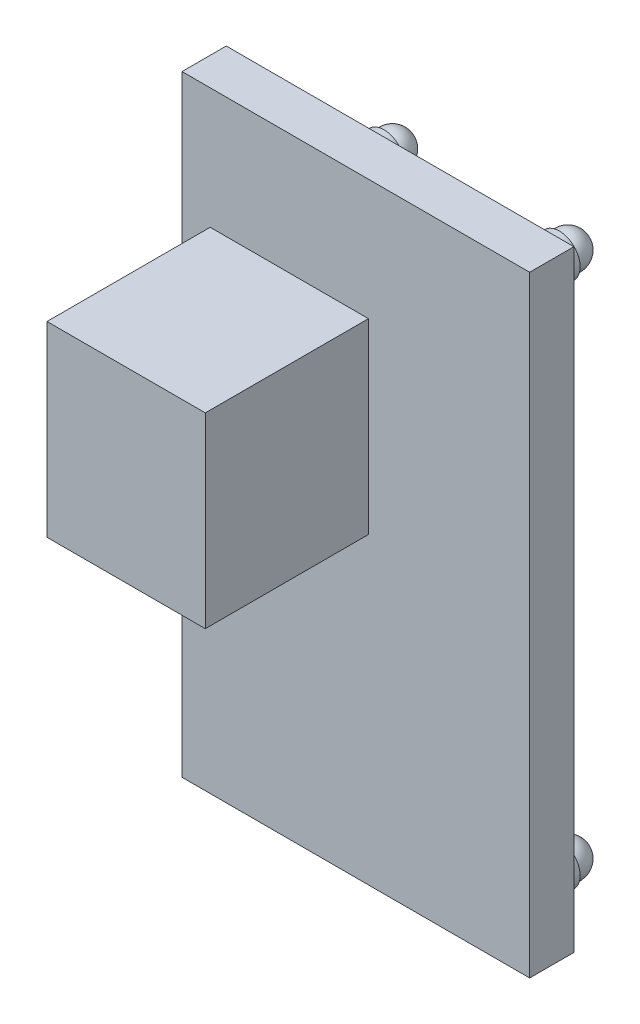
ISO-10303-21;
HEADER;
FILE_DESCRIPTION(('STEP AP214'),'2;1');
FILE_NAME('part.step','',(''),(''),'','','');
FILE_SCHEMA(('AUTOMOTIVE_DESIGN { 1 0 10303 214 1 1 1 1 }'));
ENDSEC;
DATA;
#1=APPLICATION_CONTEXT('core data for automotive mechanical design processes');
#2=APPLICATION_PROTOCOL_DEFINITION('international standard','automotive_design',2000,#1);
#3=PRODUCT_CONTEXT('',#1,'mechanical');
#4=PRODUCT('Part','Part','',(#3));
#5=PRODUCT_RELATED_PRODUCT_CATEGORY('part','',(#4));
#6=PRODUCT_DEFINITION_FORMATION('','',#4);
#7=PRODUCT_DEFINITION_CONTEXT('part definition',#1,'design');
#8=PRODUCT_DEFINITION('design','',#6,#7);
#9=PRODUCT_DEFINITION_SHAPE('','',#8);
#10=(LENGTH_UNIT() NAMED_UNIT(*) SI_UNIT(.MILLI.,.METRE.));
#11=(NAMED_UNIT(*) PLANE_ANGLE_UNIT() SI_UNIT($,.RADIAN.));
#12=(NAMED_UNIT(*) SI_UNIT($,.STERADIAN.) SOLID_ANGLE_UNIT());
#13=UNCERTAINTY_MEASURE_WITH_UNIT(LENGTH_MEASURE(1.E-05),#10,'distance_accuracy_value','');
#14=(GEOMETRIC_REPRESENTATION_CONTEXT(3) GLOBAL_UNCERTAINTY_ASSIGNED_CONTEXT((#13)) GLOBAL_UNIT_ASSIGNED_CONTEXT((#10,
#11,#12)) REPRESENTATION_CONTEXT('',''));
#15=CARTESIAN_POINT('',(0.,0.,0.));
#16=DIRECTION('',(0.,0.,1.));
#17=DIRECTION('',(1.,0.,0.));
#18=AXIS2_PLACEMENT_3D('',#15,#16,#17);
#19=CARTESIAN_POINT('',(4.76,9.53,0.7));
#20=DIRECTION('',(0.,0.,1.));
#21=DIRECTION('',(-1.,0.,0.));
#22=AXIS2_PLACEMENT_3D('',#19,#20,#21);
#23=SPHERICAL_SURFACE('',#22,0.65);
#24=CARTESIAN_POINT('',(4.76,9.53,1.35));
#25=VERTEX_POINT('',#24);
#26=VERTEX_LOOP('',#25);
#27=FACE_BOUND('',#26,.T.);
#28=ADVANCED_FACE('F49',(#27),#23,.T.);
#29=CLOSED_SHELL('',(#28));
#30=MANIFOLD_SOLID_BREP('B2',#29);
#31=CARTESIAN_POINT('',(0.,0.,3.6));
#32=DIRECTION('',(0.,0.,-1.));
#33=DIRECTION('',(-1.,0.,0.));
#34=AXIS2_PLACEMENT_3D('',#31,#32,#33);
#35=PLANE('',#34);
#36=DIRECTION('',(0.,1.,0.));
#37=VECTOR('',#36,1.);
#38=CARTESIAN_POINT('',(6.285,-11.05,3.6));
#39=LINE('',#38,#37);
#40=CARTESIAN_POINT('',(6.285,-11.05,3.6));
#41=VERTEX_POINT('',#40);
#42=CARTESIAN_POINT('',(6.285,11.05,3.6));
#43=VERTEX_POINT('',#42);
#44=EDGE_CURVE('E166',#41,#43,#39,.T.);
#45=ORIENTED_EDGE('',*,*,#44,.T.);
#46=DIRECTION('',(-1.,0.,0.));
#47=VECTOR('',#46,1.);
#48=CARTESIAN_POINT('',(-6.285,11.05,3.6));
#49=LINE('',#48,#47);
#50=CARTESIAN_POINT('',(-6.285,11.05,3.6));
#51=VERTEX_POINT('',#50);
#52=EDGE_CURVE('E170',#43,#51,#49,.T.);
#53=ORIENTED_EDGE('',*,*,#52,.T.);
#54=DIRECTION('',(0.,-1.,0.));
#55=VECTOR('',#54,1.);
#56=CARTESIAN_POINT('',(-6.285,-11.05,3.6));
#57=LINE('',#56,#55);
#58=CARTESIAN_POINT('',(-6.285,-11.05,3.6));
#59=VERTEX_POINT('',#58);
#60=EDGE_CURVE('E174',#51,#59,#57,.T.);
#61=ORIENTED_EDGE('',*,*,#60,.T.);
#62=DIRECTION('',(1.,0.,0.));
#63=VECTOR('',#62,1.);
#64=CARTESIAN_POINT('',(-6.285,-11.05,3.6));
#65=LINE('',#64,#63);
#66=EDGE_CURVE('E177',#59,#41,#65,.T.);
#67=ORIENTED_EDGE('',*,*,#66,.T.);
#68=EDGE_LOOP('',(#45,#53,#61,#67));
#69=FACE_BOUND('',#68,.T.);
#70=DIRECTION('',(0.,1.,0.));
#71=VECTOR('',#70,1.);
#72=CARTESIAN_POINT('',(0.45667083602663,6.68261656718966,3.6));
#73=LINE('',#72,#71);
#74=CARTESIAN_POINT('',(0.45667083602663,-0.0761118060044327,3.6));
#75=VERTEX_POINT('',#74);
#76=CARTESIAN_POINT('',(0.45667083602663,6.68261656718966,3.6));
#77=VERTEX_POINT('',#76);
#78=EDGE_CURVE('E82',#75,#77,#73,.T.);
#79=ORIENTED_EDGE('',*,*,#78,.F.);
#80=DIRECTION('',(1.,0.,0.));
#81=VECTOR('',#80,1.);
#82=CARTESIAN_POINT('',(-5.2669369755071,-0.0761118060044327,3.6));
#83=LINE('',#82,#81);
#84=CARTESIAN_POINT('',(-5.2669369755071,-0.0761118060044327,3.6));
#85=VERTEX_POINT('',#84);
#86=EDGE_CURVE('E86',#85,#75,#83,.T.);
#87=ORIENTED_EDGE('',*,*,#86,.F.);
#88=DIRECTION('',(0.,-1.,0.));
#89=VECTOR('',#88,1.);
#90=CARTESIAN_POINT('',(-5.2669369755071,6.68261656718966,3.6));
#91=LINE('',#90,#89);
#92=CARTESIAN_POINT('',(-5.2669369755071,6.68261656718966,3.6));
#93=VERTEX_POINT('',#92);
#94=EDGE_CURVE('E520',#93,#85,#91,.T.);
#95=ORIENTED_EDGE('',*,*,#94,.F.);
#96=DIRECTION('',(-1.,0.,0.));
#97=VECTOR('',#96,1.);
#98=CARTESIAN_POINT('',(-5.2669369755071,6.68261656718966,3.6));
#99=LINE('',#98,#97);
#100=EDGE_CURVE('E517',#77,#93,#99,.T.);
#101=ORIENTED_EDGE('',*,*,#100,.F.);
#102=EDGE_LOOP('',(#79,#87,#95,#101));
#103=FACE_BOUND('',#102,.T.);
#104=ADVANCED_FACE('F64',(#69,#103),#35,.F.);
#105=CARTESIAN_POINT('',(6.285,-11.05,3.6));
#106=DIRECTION('',(-1.,0.,0.));
#107=DIRECTION('',(0.,0.,1.));
#108=AXIS2_PLACEMENT_3D('',#105,#106,#107);
#109=PLANE('',#108);
#110=DIRECTION('',(0.,1.,0.));
#111=VECTOR('',#110,1.);
#112=CARTESIAN_POINT('',(6.285,-11.05,2.));
#113=LINE('',#112,#111);
#114=CARTESIAN_POINT('',(6.285,-11.05,2.));
#115=VERTEX_POINT('',#114);
#116=CARTESIAN_POINT('',(6.285,11.05,2.));
#117=VERTEX_POINT('',#116);
#118=EDGE_CURVE('E155',#115,#117,#113,.T.);
#119=ORIENTED_EDGE('',*,*,#118,.T.);
#120=DIRECTION('',(0.,0.,-1.));
#121=VECTOR('',#120,1.);
#122=CARTESIAN_POINT('',(6.285,11.05,3.6));
#123=LINE('',#122,#121);
#124=EDGE_CURVE('E47',#43,#117,#123,.T.);
#125=ORIENTED_EDGE('',*,*,#124,.F.);
#126=ORIENTED_EDGE('',*,*,#44,.F.);
#127=DIRECTION('',(0.,0.,-1.));
#128=VECTOR('',#127,1.);
#129=CARTESIAN_POINT('',(6.285,-11.05,3.6));
#130=LINE('',#129,#128);
#131=EDGE_CURVE('E179',#41,#115,#130,.T.);
#132=ORIENTED_EDGE('',*,*,#131,.T.);
#133=EDGE_LOOP('',(#119,#125,#126,#132));
#134=FACE_BOUND('',#133,.T.);
#135=ADVANCED_FACE('F66',(#134),#109,.F.);
#136=CARTESIAN_POINT('',(-6.285,11.05,3.6));
#137=DIRECTION('',(0.,-1.,0.));
#138=DIRECTION('',(0.,0.,-1.));
#139=AXIS2_PLACEMENT_3D('',#136,#137,#138);
#140=PLANE('',#139);
#141=DIRECTION('',(-1.,0.,0.));
#142=VECTOR('',#141,1.);
#143=CARTESIAN_POINT('',(-6.285,11.05,2.));
#144=LINE('',#143,#142);
#145=CARTESIAN_POINT('',(-6.285,11.05,2.));
#146=VERTEX_POINT('',#145);
#147=EDGE_CURVE('E160',#117,#146,#144,.T.);
#148=ORIENTED_EDGE('',*,*,#147,.T.);
#149=DIRECTION('',(0.,0.,-1.));
#150=VECTOR('',#149,1.);
#151=CARTESIAN_POINT('',(-6.285,11.05,3.6));
#152=LINE('',#151,#150);
#153=EDGE_CURVE('E74',#51,#146,#152,.T.);
#154=ORIENTED_EDGE('',*,*,#153,.F.);
#155=ORIENTED_EDGE('',*,*,#52,.F.);
#156=ORIENTED_EDGE('',*,*,#124,.T.);
#157=EDGE_LOOP('',(#148,#154,#155,#156));
#158=FACE_BOUND('',#157,.T.);
#159=ADVANCED_FACE('F230',(#158),#140,.F.);
#160=CARTESIAN_POINT('',(-6.285,-11.05,3.6));
#161=DIRECTION('',(1.,0.,0.));
#162=DIRECTION('',(0.,0.,-1.));
#163=AXIS2_PLACEMENT_3D('',#160,#161,#162);
#164=PLANE('',#163);
#165=DIRECTION('',(0.,-1.,0.));
#166=VECTOR('',#165,1.);
#167=CARTESIAN_POINT('',(-6.285,-11.05,2.));
#168=LINE('',#167,#166);
#169=CARTESIAN_POINT('',(-6.285,-11.05,2.));
#170=VERTEX_POINT('',#169);
#171=EDGE_CURVE('E183',#146,#170,#168,.T.);
#172=ORIENTED_EDGE('',*,*,#171,.T.);
#173=DIRECTION('',(0.,0.,-1.));
#174=VECTOR('',#173,1.);
#175=CARTESIAN_POINT('',(-6.285,-11.05,3.6));
#176=LINE('',#175,#174);
#177=EDGE_CURVE('E191',#59,#170,#176,.T.);
#178=ORIENTED_EDGE('',*,*,#177,.F.);
#179=ORIENTED_EDGE('',*,*,#60,.F.);
#180=ORIENTED_EDGE('',*,*,#153,.T.);
#181=EDGE_LOOP('',(#172,#178,#179,#180));
#182=FACE_BOUND('',#181,.T.);
#183=ADVANCED_FACE('F242',(#182),#164,.F.);
#184=CARTESIAN_POINT('',(-6.285,-11.05,3.6));
#185=DIRECTION('',(0.,1.,0.));
#186=DIRECTION('',(0.,0.,1.));
#187=AXIS2_PLACEMENT_3D('',#184,#185,#186);
#188=PLANE('',#187);
#189=DIRECTION('',(1.,0.,0.));
#190=VECTOR('',#189,1.);
#191=CARTESIAN_POINT('',(-6.285,-11.05,2.));
#192=LINE('',#191,#190);
#193=EDGE_CURVE('E171',#170,#115,#192,.T.);
#194=ORIENTED_EDGE('',*,*,#193,.T.);
#195=ORIENTED_EDGE('',*,*,#131,.F.);
#196=ORIENTED_EDGE('',*,*,#66,.F.);
#197=ORIENTED_EDGE('',*,*,#177,.T.);
#198=EDGE_LOOP('',(#194,#195,#196,#197));
#199=FACE_BOUND('',#198,.T.);
#200=ADVANCED_FACE('F238',(#199),#188,.F.);
#201=CARTESIAN_POINT('',(0.,0.,2.));
#202=DIRECTION('',(0.,0.,-1.));
#203=DIRECTION('',(-1.,0.,0.));
#204=AXIS2_PLACEMENT_3D('',#201,#202,#203);
#205=PLANE('',#204);
#206=CARTESIAN_POINT('',(-1.58,9.53,2.));
#207=DIRECTION('',(0.,0.,-1.));
#208=DIRECTION('',(-1.,0.,0.));
#209=AXIS2_PLACEMENT_3D('',#206,#207,#208);
#210=CIRCLE('',#209,0.75);
#211=CARTESIAN_POINT('',(-2.33,9.53,2.));
#212=VERTEX_POINT('',#211);
#213=EDGE_CURVE('E480',#212,#212,#210,.T.);
#214=ORIENTED_EDGE('',*,*,#213,.F.);
#215=EDGE_LOOP('',(#214));
#216=FACE_BOUND('',#215,.T.);
#217=CARTESIAN_POINT('',(-4.76,-9.53,2.));
#218=DIRECTION('',(0.,0.,-1.));
#219=DIRECTION('',(-1.,0.,0.));
#220=AXIS2_PLACEMENT_3D('',#217,#218,#219);
#221=CIRCLE('',#220,0.75);
#222=CARTESIAN_POINT('',(-5.51,-9.53,2.));
#223=VERTEX_POINT('',#222);
#224=EDGE_CURVE('E487',#223,#223,#221,.T.);
#225=ORIENTED_EDGE('',*,*,#224,.F.);
#226=EDGE_LOOP('',(#225));
#227=FACE_BOUND('',#226,.T.);
#228=CARTESIAN_POINT('',(4.76,-9.53,2.));
#229=DIRECTION('',(0.,0.,-1.));
#230=DIRECTION('',(-1.,0.,0.));
#231=AXIS2_PLACEMENT_3D('',#228,#229,#230);
#232=CIRCLE('',#231,0.75);
#233=CARTESIAN_POINT('',(4.01,-9.53,2.));
#234=VERTEX_POINT('',#233);
#235=EDGE_CURVE('E495',#234,#234,#232,.T.);
#236=ORIENTED_EDGE('',*,*,#235,.F.);
#237=EDGE_LOOP('',(#236));
#238=FACE_BOUND('',#237,.T.);
#239=CARTESIAN_POINT('',(4.76,9.53,2.));
#240=DIRECTION('',(0.,0.,-1.));
#241=DIRECTION('',(-1.,0.,0.));
#242=AXIS2_PLACEMENT_3D('',#239,#240,#241);
#243=CIRCLE('',#242,0.75);
#244=CARTESIAN_POINT('',(4.01,9.53,2.));
#245=VERTEX_POINT('',#244);
#246=EDGE_CURVE('E499',#245,#245,#243,.T.);
#247=ORIENTED_EDGE('',*,*,#246,.F.);
#248=EDGE_LOOP('',(#247));
#249=FACE_BOUND('',#248,.T.);
#250=ORIENTED_EDGE('',*,*,#118,.F.);
#251=ORIENTED_EDGE('',*,*,#193,.F.);
#252=ORIENTED_EDGE('',*,*,#171,.F.);
#253=ORIENTED_EDGE('',*,*,#147,.F.);
#254=EDGE_LOOP('',(#250,#251,#252,#253));
#255=FACE_BOUND('',#254,.T.);
#256=ADVANCED_FACE('F235',(#216,#227,#238,#249,#255),#205,.T.);
#257=CARTESIAN_POINT('',(0.45667083602663,6.68261656718966,9.5));
#258=DIRECTION('',(-1.,0.,0.));
#259=DIRECTION('',(0.,0.,1.));
#260=AXIS2_PLACEMENT_3D('',#257,#258,#259);
#261=PLANE('',#260);
#262=ORIENTED_EDGE('',*,*,#78,.T.);
#263=DIRECTION('',(0.,0.,-1.));
#264=VECTOR('',#263,1.);
#265=CARTESIAN_POINT('',(0.45667083602663,6.68261656718966,9.5));
#266=LINE('',#265,#264);
#267=CARTESIAN_POINT('',(0.45667083602663,6.68261656718966,9.5));
#268=VERTEX_POINT('',#267);
#269=EDGE_CURVE('E135',#268,#77,#266,.T.);
#270=ORIENTED_EDGE('',*,*,#269,.F.);
#271=DIRECTION('',(0.,1.,0.));
#272=VECTOR('',#271,1.);
#273=CARTESIAN_POINT('',(0.45667083602663,6.68261656718966,9.5));
#274=LINE('',#273,#272);
#275=CARTESIAN_POINT('',(0.45667083602663,-0.0761118060044327,9.5));
#276=VERTEX_POINT('',#275);
#277=EDGE_CURVE('E142',#276,#268,#274,.T.);
#278=ORIENTED_EDGE('',*,*,#277,.F.);
#279=DIRECTION('',(0.,0.,-1.));
#280=VECTOR('',#279,1.);
#281=CARTESIAN_POINT('',(0.45667083602663,-0.0761118060044327,9.5));
#282=LINE('',#281,#280);
#283=EDGE_CURVE('E514',#276,#75,#282,.T.);
#284=ORIENTED_EDGE('',*,*,#283,.T.);
#285=EDGE_LOOP('',(#262,#270,#278,#284));
#286=FACE_BOUND('',#285,.T.);
#287=ADVANCED_FACE('F153',(#286),#261,.F.);
#288=CARTESIAN_POINT('',(-5.2669369755071,6.68261656718966,9.5));
#289=DIRECTION('',(0.,-1.,0.));
#290=DIRECTION('',(0.,0.,-1.));
#291=AXIS2_PLACEMENT_3D('',#288,#289,#290);
#292=PLANE('',#291);
#293=ORIENTED_EDGE('',*,*,#100,.T.);
#294=DIRECTION('',(0.,0.,-1.));
#295=VECTOR('',#294,1.);
#296=CARTESIAN_POINT('',(-5.2669369755071,6.68261656718966,9.5));
#297=LINE('',#296,#295);
#298=CARTESIAN_POINT('',(-5.2669369755071,6.68261656718966,9.5));
#299=VERTEX_POINT('',#298);
#300=EDGE_CURVE('E137',#299,#93,#297,.T.);
#301=ORIENTED_EDGE('',*,*,#300,.F.);
#302=DIRECTION('',(-1.,0.,0.));
#303=VECTOR('',#302,1.);
#304=CARTESIAN_POINT('',(-5.2669369755071,6.68261656718966,9.5));
#305=LINE('',#304,#303);
#306=EDGE_CURVE('E130',#268,#299,#305,.T.);
#307=ORIENTED_EDGE('',*,*,#306,.F.);
#308=ORIENTED_EDGE('',*,*,#269,.T.);
#309=EDGE_LOOP('',(#293,#301,#307,#308));
#310=FACE_BOUND('',#309,.T.);
#311=ADVANCED_FACE('F133',(#310),#292,.F.);
#312=CARTESIAN_POINT('',(-5.2669369755071,6.68261656718966,9.5));
#313=DIRECTION('',(1.,0.,0.));
#314=DIRECTION('',(0.,0.,-1.));
#315=AXIS2_PLACEMENT_3D('',#312,#313,#314);
#316=PLANE('',#315);
#317=ORIENTED_EDGE('',*,*,#94,.T.);
#318=DIRECTION('',(0.,0.,-1.));
#319=VECTOR('',#318,1.);
#320=CARTESIAN_POINT('',(-5.2669369755071,-0.0761118060044327,9.5));
#321=LINE('',#320,#319);
#322=CARTESIAN_POINT('',(-5.2669369755071,-0.0761118060044327,9.5));
#323=VERTEX_POINT('',#322);
#324=EDGE_CURVE('E162',#323,#85,#321,.T.);
#325=ORIENTED_EDGE('',*,*,#324,.F.);
#326=DIRECTION('',(0.,-1.,0.));
#327=VECTOR('',#326,1.);
#328=CARTESIAN_POINT('',(-5.2669369755071,6.68261656718966,9.5));
#329=LINE('',#328,#327);
#330=EDGE_CURVE('E141',#299,#323,#329,.T.);
#331=ORIENTED_EDGE('',*,*,#330,.F.);
#332=ORIENTED_EDGE('',*,*,#300,.T.);
#333=EDGE_LOOP('',(#317,#325,#331,#332));
#334=FACE_BOUND('',#333,.T.);
#335=ADVANCED_FACE('F288',(#334),#316,.F.);
#336=CARTESIAN_POINT('',(-5.2669369755071,-0.0761118060044327,9.5));
#337=DIRECTION('',(0.,1.,0.));
#338=DIRECTION('',(0.,0.,1.));
#339=AXIS2_PLACEMENT_3D('',#336,#337,#338);
#340=PLANE('',#339);
#341=ORIENTED_EDGE('',*,*,#86,.T.);
#342=ORIENTED_EDGE('',*,*,#283,.F.);
#343=DIRECTION('',(1.,0.,0.));
#344=VECTOR('',#343,1.);
#345=CARTESIAN_POINT('',(-5.2669369755071,-0.0761118060044327,9.5));
#346=LINE('',#345,#344);
#347=EDGE_CURVE('E147',#323,#276,#346,.T.);
#348=ORIENTED_EDGE('',*,*,#347,.F.);
#349=ORIENTED_EDGE('',*,*,#324,.T.);
#350=EDGE_LOOP('',(#341,#342,#348,#349));
#351=FACE_BOUND('',#350,.T.);
#352=ADVANCED_FACE('F294',(#351),#340,.F.);
#353=CARTESIAN_POINT('',(0.,0.,9.5));
#354=DIRECTION('',(0.,0.,1.));
#355=DIRECTION('',(1.,0.,0.));
#356=AXIS2_PLACEMENT_3D('',#353,#354,#355);
#357=PLANE('',#356);
#358=ORIENTED_EDGE('',*,*,#277,.T.);
#359=ORIENTED_EDGE('',*,*,#306,.T.);
#360=ORIENTED_EDGE('',*,*,#330,.T.);
#361=ORIENTED_EDGE('',*,*,#347,.T.);
#362=EDGE_LOOP('',(#358,#359,#360,#361));
#363=FACE_BOUND('',#362,.T.);
#364=ADVANCED_FACE('F145',(#363),#357,.T.);
#365=CARTESIAN_POINT('',(4.76,9.53,1.));
#366=DIRECTION('',(0.,0.,1.));
#367=DIRECTION('',(1.,0.,0.));
#368=AXIS2_PLACEMENT_3D('',#365,#366,#367);
#369=CYLINDRICAL_SURFACE('',#368,0.75);
#370=CARTESIAN_POINT('',(4.76,9.53,1.));
#371=DIRECTION('',(0.,0.,-1.));
#372=DIRECTION('',(-1.,0.,0.));
#373=AXIS2_PLACEMENT_3D('',#370,#371,#372);
#374=CIRCLE('',#373,0.75);
#375=CARTESIAN_POINT('',(4.01,9.53,1.));
#376=VERTEX_POINT('',#375);
#377=EDGE_CURVE('E503',#376,#376,#374,.T.);
#378=ORIENTED_EDGE('',*,*,#377,.F.);
#379=EDGE_LOOP('',(#378));
#380=FACE_BOUND('',#379,.T.);
#381=ORIENTED_EDGE('',*,*,#246,.T.);
#382=EDGE_LOOP('',(#381));
#383=FACE_BOUND('',#382,.T.);
#384=ADVANCED_FACE('F308',(#380,#383),#369,.T.);
#385=CARTESIAN_POINT('',(4.76,9.53,1.));
#386=DIRECTION('',(0.,0.,-1.));
#387=DIRECTION('',(-1.,0.,0.));
#388=AXIS2_PLACEMENT_3D('',#385,#386,#387);
#389=PLANE('',#388);
#390=ORIENTED_EDGE('',*,*,#377,.T.);
#391=EDGE_LOOP('',(#390));
#392=FACE_BOUND('',#391,.T.);
#393=ADVANCED_FACE('F314',(#392),#389,.T.);
#394=CARTESIAN_POINT('',(4.76,-9.53,1.));
#395=DIRECTION('',(0.,0.,1.));
#396=DIRECTION('',(1.,0.,0.));
#397=AXIS2_PLACEMENT_3D('',#394,#395,#396);
#398=CYLINDRICAL_SURFACE('',#397,0.75);
#399=CARTESIAN_POINT('',(4.76,-9.53,1.));
#400=DIRECTION('',(0.,0.,-1.));
#401=DIRECTION('',(-1.,0.,0.));
#402=AXIS2_PLACEMENT_3D('',#399,#400,#401);
#403=CIRCLE('',#402,0.75);
#404=CARTESIAN_POINT('',(4.01,-9.53,1.));
#405=VERTEX_POINT('',#404);
#406=EDGE_CURVE('E491',#405,#405,#403,.T.);
#407=ORIENTED_EDGE('',*,*,#406,.F.);
#408=EDGE_LOOP('',(#407));
#409=FACE_BOUND('',#408,.T.);
#410=ORIENTED_EDGE('',*,*,#235,.T.);
#411=EDGE_LOOP('',(#410));
#412=FACE_BOUND('',#411,.T.);
#413=ADVANCED_FACE('F322',(#409,#412),#398,.T.);
#414=CARTESIAN_POINT('',(4.76,-9.53,1.));
#415=DIRECTION('',(0.,0.,-1.));
#416=DIRECTION('',(-1.,0.,0.));
#417=AXIS2_PLACEMENT_3D('',#414,#415,#416);
#418=PLANE('',#417);
#419=CARTESIAN_POINT('',(4.76,-9.53,1.));
#420=DIRECTION('',(0.,0.,-1.));
#421=DIRECTION('',(-1.,0.,0.));
#422=AXIS2_PLACEMENT_3D('',#419,#420,#421);
#423=CIRCLE('',#422,0.57662812973354);
#424=CARTESIAN_POINT('',(4.18337187026646,-9.53,1.));
#425=VERTEX_POINT('',#424);
#426=EDGE_CURVE('E202',#425,#425,#423,.F.);
#427=ORIENTED_EDGE('',*,*,#426,.T.);
#428=EDGE_LOOP('',(#427));
#429=FACE_BOUND('',#428,.T.);
#430=ORIENTED_EDGE('',*,*,#406,.T.);
#431=EDGE_LOOP('',(#430));
#432=FACE_BOUND('',#431,.T.);
#433=ADVANCED_FACE('F330',(#429,#432),#418,.T.);
#434=CARTESIAN_POINT('',(-4.76,-9.53,1.));
#435=DIRECTION('',(0.,0.,1.));
#436=DIRECTION('',(1.,0.,0.));
#437=AXIS2_PLACEMENT_3D('',#434,#435,#436);
#438=CYLINDRICAL_SURFACE('',#437,0.75);
#439=CARTESIAN_POINT('',(-4.76,-9.53,1.));
#440=DIRECTION('',(0.,0.,-1.));
#441=DIRECTION('',(-1.,0.,0.));
#442=AXIS2_PLACEMENT_3D('',#439,#440,#441);
#443=CIRCLE('',#442,0.75);
#444=CARTESIAN_POINT('',(-5.51,-9.53,1.));
#445=VERTEX_POINT('',#444);
#446=EDGE_CURVE('E484',#445,#445,#443,.T.);
#447=ORIENTED_EDGE('',*,*,#446,.F.);
#448=EDGE_LOOP('',(#447));
#449=FACE_BOUND('',#448,.T.);
#450=ORIENTED_EDGE('',*,*,#224,.T.);
#451=EDGE_LOOP('',(#450));
#452=FACE_BOUND('',#451,.T.);
#453=ADVANCED_FACE('F339',(#449,#452),#438,.T.);
#454=CARTESIAN_POINT('',(-4.76,-9.53,1.));
#455=DIRECTION('',(0.,0.,-1.));
#456=DIRECTION('',(-1.,0.,0.));
#457=AXIS2_PLACEMENT_3D('',#454,#455,#456);
#458=PLANE('',#457);
#459=CARTESIAN_POINT('',(-4.76,-9.53,1.));
#460=DIRECTION('',(0.,0.,-1.));
#461=DIRECTION('',(-1.,0.,0.));
#462=AXIS2_PLACEMENT_3D('',#459,#460,#461);
#463=CIRCLE('',#462,0.57662812973354);
#464=CARTESIAN_POINT('',(-5.33662812973354,-9.53,1.));
#465=VERTEX_POINT('',#464);
#466=EDGE_CURVE('E68',#465,#465,#463,.F.);
#467=ORIENTED_EDGE('',*,*,#466,.T.);
#468=EDGE_LOOP('',(#467));
#469=FACE_BOUND('',#468,.T.);
#470=ORIENTED_EDGE('',*,*,#446,.T.);
#471=EDGE_LOOP('',(#470));
#472=FACE_BOUND('',#471,.T.);
#473=ADVANCED_FACE('F211',(#469,#472),#458,.T.);
#474=CARTESIAN_POINT('',(-1.58,9.53,1.));
#475=DIRECTION('',(0.,0.,1.));
#476=DIRECTION('',(1.,0.,0.));
#477=AXIS2_PLACEMENT_3D('',#474,#475,#476);
#478=CYLINDRICAL_SURFACE('',#477,0.75);
#479=CARTESIAN_POINT('',(-1.58,9.53,1.));
#480=DIRECTION('',(0.,0.,-1.));
#481=DIRECTION('',(-1.,0.,0.));
#482=AXIS2_PLACEMENT_3D('',#479,#480,#481);
#483=CIRCLE('',#482,0.75);
#484=CARTESIAN_POINT('',(-2.33,9.53,1.));
#485=VERTEX_POINT('',#484);
#486=EDGE_CURVE('E201',#485,#485,#483,.T.);
#487=ORIENTED_EDGE('',*,*,#486,.F.);
#488=EDGE_LOOP('',(#487));
#489=FACE_BOUND('',#488,.T.);
#490=ORIENTED_EDGE('',*,*,#213,.T.);
#491=EDGE_LOOP('',(#490));
#492=FACE_BOUND('',#491,.T.);
#493=ADVANCED_FACE('F353',(#489,#492),#478,.T.);
#494=CARTESIAN_POINT('',(-1.58,9.53,1.));
#495=DIRECTION('',(0.,0.,-1.));
#496=DIRECTION('',(-1.,0.,0.));
#497=AXIS2_PLACEMENT_3D('',#494,#495,#496);
#498=PLANE('',#497);
#499=CARTESIAN_POINT('',(-1.58,9.53,1.));
#500=DIRECTION('',(0.,0.,-1.));
#501=DIRECTION('',(-1.,0.,0.));
#502=AXIS2_PLACEMENT_3D('',#499,#500,#501);
#503=CIRCLE('',#502,0.57662812973354);
#504=CARTESIAN_POINT('',(-2.15662812973354,9.53,1.));
#505=VERTEX_POINT('',#504);
#506=EDGE_CURVE('E198',#505,#505,#503,.F.);
#507=ORIENTED_EDGE('',*,*,#506,.T.);
#508=EDGE_LOOP('',(#507));
#509=FACE_BOUND('',#508,.T.);
#510=ORIENTED_EDGE('',*,*,#486,.T.);
#511=EDGE_LOOP('',(#510));
#512=FACE_BOUND('',#511,.T.);
#513=ADVANCED_FACE('F360',(#509,#512),#498,.T.);
#514=CARTESIAN_POINT('',(-1.58,9.53,0.7));
#515=DIRECTION('',(0.,0.,1.));
#516=DIRECTION('',(-1.,0.,0.));
#517=AXIS2_PLACEMENT_3D('',#514,#515,#516);
#518=SPHERICAL_SURFACE('',#517,0.65);
#519=ORIENTED_EDGE('',*,*,#506,.F.);
#520=EDGE_LOOP('',(#519));
#521=FACE_BOUND('',#520,.T.);
#522=ADVANCED_FACE('F221',(#521),#518,.T.);
#523=CARTESIAN_POINT('',(4.76,-9.53,0.7));
#524=DIRECTION('',(0.,0.,1.));
#525=DIRECTION('',(-1.,0.,0.));
#526=AXIS2_PLACEMENT_3D('',#523,#524,#525);
#527=SPHERICAL_SURFACE('',#526,0.65);
#528=ORIENTED_EDGE('',*,*,#426,.F.);
#529=EDGE_LOOP('',(#528));
#530=FACE_BOUND('',#529,.T.);
#531=ADVANCED_FACE('F216',(#530),#527,.T.);
#532=CARTESIAN_POINT('',(-4.76,-9.53,0.7));
#533=DIRECTION('',(0.,0.,1.));
#534=DIRECTION('',(-1.,0.,0.));
#535=AXIS2_PLACEMENT_3D('',#532,#533,#534);
#536=SPHERICAL_SURFACE('',#535,0.65);
#537=ORIENTED_EDGE('',*,*,#466,.F.);
#538=EDGE_LOOP('',(#537));
#539=FACE_BOUND('',#538,.T.);
#540=ADVANCED_FACE('F214',(#539),#536,.T.);
#541=CLOSED_SHELL('',(#104,#135,#159,#183,#200,#256,#287,#311,#335,#352,#364,#384,#393,#413,
#433,#453,#473,#493,#513,#522,#531,#540));
#542=MANIFOLD_SOLID_BREP('B6',#541);
#543=ADVANCED_BREP_SHAPE_REPRESENTATION('',(#18,#30,#542),#14);
#544=SHAPE_DEFINITION_REPRESENTATION(#9,#543);
ENDSEC;
END-ISO-10303-21;
